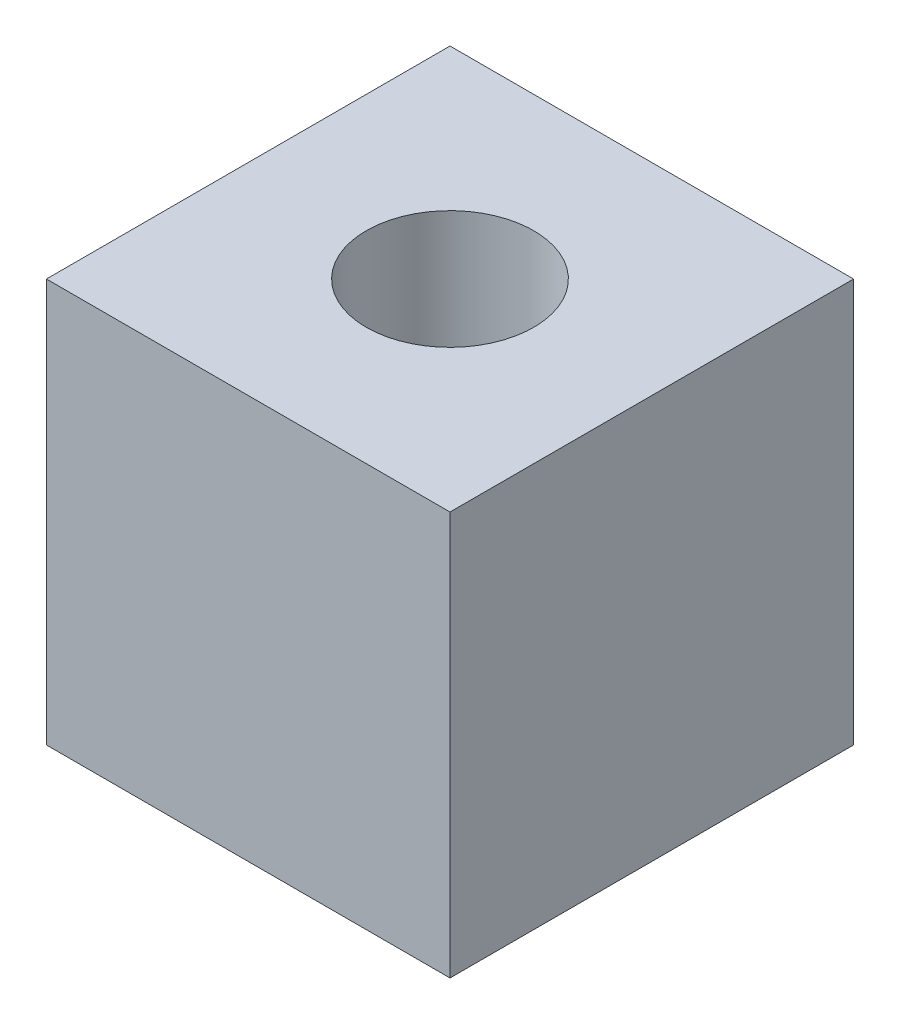
ISO-10303-21;
HEADER;
FILE_DESCRIPTION(('STEP AP214'),'2;1');
FILE_NAME('part.step','',(''),(''),'','','');
FILE_SCHEMA(('AUTOMOTIVE_DESIGN { 1 0 10303 214 1 1 1 1 }'));
ENDSEC;
DATA;
#1=APPLICATION_CONTEXT('core data for automotive mechanical design processes');
#2=APPLICATION_PROTOCOL_DEFINITION('international standard','automotive_design',2000,#1);
#3=PRODUCT_CONTEXT('',#1,'mechanical');
#4=PRODUCT('Part','Part','',(#3));
#5=PRODUCT_RELATED_PRODUCT_CATEGORY('part','',(#4));
#6=PRODUCT_DEFINITION_FORMATION('','',#4);
#7=PRODUCT_DEFINITION_CONTEXT('part definition',#1,'design');
#8=PRODUCT_DEFINITION('design','',#6,#7);
#9=PRODUCT_DEFINITION_SHAPE('','',#8);
#10=(LENGTH_UNIT() NAMED_UNIT(*) SI_UNIT(.MILLI.,.METRE.));
#11=(NAMED_UNIT(*) PLANE_ANGLE_UNIT() SI_UNIT($,.RADIAN.));
#12=(NAMED_UNIT(*) SI_UNIT($,.STERADIAN.) SOLID_ANGLE_UNIT());
#13=UNCERTAINTY_MEASURE_WITH_UNIT(LENGTH_MEASURE(1.E-05),#10,'distance_accuracy_value','');
#14=(GEOMETRIC_REPRESENTATION_CONTEXT(3) GLOBAL_UNCERTAINTY_ASSIGNED_CONTEXT((#13)) GLOBAL_UNIT_ASSIGNED_CONTEXT((#10,
#11,#12)) REPRESENTATION_CONTEXT('',''));
#15=CARTESIAN_POINT('',(0.,0.,0.));
#16=DIRECTION('',(0.,0.,1.));
#17=DIRECTION('',(1.,0.,0.));
#18=AXIS2_PLACEMENT_3D('',#15,#16,#17);
#19=CARTESIAN_POINT('',(0.,20.,0.));
#20=DIRECTION('',(-1.,0.,0.));
#21=DIRECTION('',(0.,0.,1.));
#22=AXIS2_PLACEMENT_3D('',#19,#20,#21);
#23=PLANE('',#22);
#24=DIRECTION('',(0.,0.,-1.));
#25=VECTOR('',#24,1.);
#26=CARTESIAN_POINT('',(0.,0.,0.));
#27=LINE('',#26,#25);
#28=CARTESIAN_POINT('',(0.,0.,0.));
#29=VERTEX_POINT('',#28);
#30=CARTESIAN_POINT('',(0.,0.,-20.));
#31=VERTEX_POINT('',#30);
#32=EDGE_CURVE('E111',#29,#31,#27,.T.);
#33=ORIENTED_EDGE('',*,*,#32,.T.);
#34=DIRECTION('',(0.,-1.,0.));
#35=VECTOR('',#34,1.);
#36=CARTESIAN_POINT('',(0.,20.,-20.));
#37=LINE('',#36,#35);
#38=CARTESIAN_POINT('',(0.,20.,-20.));
#39=VERTEX_POINT('',#38);
#40=EDGE_CURVE('E11',#39,#31,#37,.T.);
#41=ORIENTED_EDGE('',*,*,#40,.F.);
#42=DIRECTION('',(0.,0.,-1.));
#43=VECTOR('',#42,1.);
#44=CARTESIAN_POINT('',(0.,20.,0.));
#45=LINE('',#44,#43);
#46=CARTESIAN_POINT('',(0.,20.,0.));
#47=VERTEX_POINT('',#46);
#48=EDGE_CURVE('E95',#47,#39,#45,.T.);
#49=ORIENTED_EDGE('',*,*,#48,.F.);
#50=DIRECTION('',(0.,-1.,0.));
#51=VECTOR('',#50,1.);
#52=CARTESIAN_POINT('',(0.,20.,0.));
#53=LINE('',#52,#51);
#54=EDGE_CURVE('E107',#47,#29,#53,.T.);
#55=ORIENTED_EDGE('',*,*,#54,.T.);
#56=EDGE_LOOP('',(#33,#41,#49,#55));
#57=FACE_BOUND('',#56,.T.);
#58=ADVANCED_FACE('F43',(#57),#23,.F.);
#59=CARTESIAN_POINT('',(0.,20.,-20.));
#60=DIRECTION('',(0.,0.,1.));
#61=DIRECTION('',(1.,0.,0.));
#62=AXIS2_PLACEMENT_3D('',#59,#60,#61);
#63=PLANE('',#62);
#64=DIRECTION('',(-1.,0.,0.));
#65=VECTOR('',#64,1.);
#66=CARTESIAN_POINT('',(0.,0.,-20.));
#67=LINE('',#66,#65);
#68=CARTESIAN_POINT('',(-20.,0.,-20.));
#69=VERTEX_POINT('',#68);
#70=EDGE_CURVE('E100',#31,#69,#67,.T.);
#71=ORIENTED_EDGE('',*,*,#70,.T.);
#72=DIRECTION('',(0.,-1.,0.));
#73=VECTOR('',#72,1.);
#74=CARTESIAN_POINT('',(-20.,20.,-20.));
#75=LINE('',#74,#73);
#76=CARTESIAN_POINT('',(-20.,20.,-20.));
#77=VERTEX_POINT('',#76);
#78=EDGE_CURVE('E52',#77,#69,#75,.T.);
#79=ORIENTED_EDGE('',*,*,#78,.F.);
#80=DIRECTION('',(-1.,0.,0.));
#81=VECTOR('',#80,1.);
#82=CARTESIAN_POINT('',(0.,20.,-20.));
#83=LINE('',#82,#81);
#84=EDGE_CURVE('E90',#39,#77,#83,.T.);
#85=ORIENTED_EDGE('',*,*,#84,.F.);
#86=ORIENTED_EDGE('',*,*,#40,.T.);
#87=EDGE_LOOP('',(#71,#79,#85,#86));
#88=FACE_BOUND('',#87,.T.);
#89=ADVANCED_FACE('F99',(#88),#63,.F.);
#90=CARTESIAN_POINT('',(-20.,20.,0.));
#91=DIRECTION('',(1.,0.,0.));
#92=DIRECTION('',(0.,0.,-1.));
#93=AXIS2_PLACEMENT_3D('',#90,#91,#92);
#94=PLANE('',#93);
#95=DIRECTION('',(0.,0.,1.));
#96=VECTOR('',#95,1.);
#97=CARTESIAN_POINT('',(-20.,0.,0.));
#98=LINE('',#97,#96);
#99=CARTESIAN_POINT('',(-20.,0.,0.));
#100=VERTEX_POINT('',#99);
#101=EDGE_CURVE('E77',#69,#100,#98,.T.);
#102=ORIENTED_EDGE('',*,*,#101,.T.);
#103=DIRECTION('',(0.,-1.,0.));
#104=VECTOR('',#103,1.);
#105=CARTESIAN_POINT('',(-20.,20.,0.));
#106=LINE('',#105,#104);
#107=CARTESIAN_POINT('',(-20.,20.,0.));
#108=VERTEX_POINT('',#107);
#109=EDGE_CURVE('E102',#108,#100,#106,.T.);
#110=ORIENTED_EDGE('',*,*,#109,.F.);
#111=DIRECTION('',(0.,0.,1.));
#112=VECTOR('',#111,1.);
#113=CARTESIAN_POINT('',(-20.,20.,0.));
#114=LINE('',#113,#112);
#115=EDGE_CURVE('E93',#77,#108,#114,.T.);
#116=ORIENTED_EDGE('',*,*,#115,.F.);
#117=ORIENTED_EDGE('',*,*,#78,.T.);
#118=EDGE_LOOP('',(#102,#110,#116,#117));
#119=FACE_BOUND('',#118,.T.);
#120=ADVANCED_FACE('F103',(#119),#94,.F.);
#121=CARTESIAN_POINT('',(0.,20.,0.));
#122=DIRECTION('',(0.,0.,-1.));
#123=DIRECTION('',(-1.,0.,0.));
#124=AXIS2_PLACEMENT_3D('',#121,#122,#123);
#125=PLANE('',#124);
#126=DIRECTION('',(1.,0.,0.));
#127=VECTOR('',#126,1.);
#128=CARTESIAN_POINT('',(0.,0.,0.));
#129=LINE('',#128,#127);
#130=EDGE_CURVE('E83',#100,#29,#129,.T.);
#131=ORIENTED_EDGE('',*,*,#130,.T.);
#132=ORIENTED_EDGE('',*,*,#54,.F.);
#133=DIRECTION('',(1.,0.,0.));
#134=VECTOR('',#133,1.);
#135=CARTESIAN_POINT('',(0.,20.,0.));
#136=LINE('',#135,#134);
#137=EDGE_CURVE('E60',#108,#47,#136,.T.);
#138=ORIENTED_EDGE('',*,*,#137,.F.);
#139=ORIENTED_EDGE('',*,*,#109,.T.);
#140=EDGE_LOOP('',(#131,#132,#138,#139));
#141=FACE_BOUND('',#140,.T.);
#142=ADVANCED_FACE('F125',(#141),#125,.F.);
#143=CARTESIAN_POINT('',(0.,20.,0.));
#144=DIRECTION('',(0.,1.,0.));
#145=DIRECTION('',(0.,0.,1.));
#146=AXIS2_PLACEMENT_3D('',#143,#144,#145);
#147=PLANE('',#146);
#148=CARTESIAN_POINT('',(-10.,20.,-10.));
#149=DIRECTION('',(0.,1.,0.));
#150=DIRECTION('',(0.,0.,1.));
#151=AXIS2_PLACEMENT_3D('',#148,#149,#150);
#152=CIRCLE('',#151,4.15);
#153=CARTESIAN_POINT('',(-10.,20.,-5.85));
#154=VERTEX_POINT('',#153);
#155=EDGE_CURVE('E132',#154,#154,#152,.T.);
#156=ORIENTED_EDGE('',*,*,#155,.F.);
#157=EDGE_LOOP('',(#156));
#158=FACE_BOUND('',#157,.T.);
#159=ORIENTED_EDGE('',*,*,#48,.T.);
#160=ORIENTED_EDGE('',*,*,#84,.T.);
#161=ORIENTED_EDGE('',*,*,#115,.T.);
#162=ORIENTED_EDGE('',*,*,#137,.T.);
#163=EDGE_LOOP('',(#159,#160,#161,#162));
#164=FACE_BOUND('',#163,.T.);
#165=ADVANCED_FACE('F91',(#158,#164),#147,.T.);
#166=CARTESIAN_POINT('',(0.,0.,0.));
#167=DIRECTION('',(0.,1.,0.));
#168=DIRECTION('',(0.,0.,1.));
#169=AXIS2_PLACEMENT_3D('',#166,#167,#168);
#170=PLANE('',#169);
#171=CARTESIAN_POINT('',(-10.,0.,-10.));
#172=DIRECTION('',(0.,1.,0.));
#173=DIRECTION('',(0.,0.,1.));
#174=AXIS2_PLACEMENT_3D('',#171,#172,#173);
#175=CIRCLE('',#174,4.15);
#176=CARTESIAN_POINT('',(-10.,0.,-5.85));
#177=VERTEX_POINT('',#176);
#178=EDGE_CURVE('E115',#177,#177,#175,.T.);
#179=ORIENTED_EDGE('',*,*,#178,.T.);
#180=EDGE_LOOP('',(#179));
#181=FACE_BOUND('',#180,.T.);
#182=ORIENTED_EDGE('',*,*,#32,.F.);
#183=ORIENTED_EDGE('',*,*,#130,.F.);
#184=ORIENTED_EDGE('',*,*,#101,.F.);
#185=ORIENTED_EDGE('',*,*,#70,.F.);
#186=EDGE_LOOP('',(#182,#183,#184,#185));
#187=FACE_BOUND('',#186,.T.);
#188=ADVANCED_FACE('F128',(#181,#187),#170,.F.);
#189=CARTESIAN_POINT('',(-10.,0.,-10.));
#190=DIRECTION('',(0.,1.,0.));
#191=DIRECTION('',(0.,0.,1.));
#192=AXIS2_PLACEMENT_3D('',#189,#190,#191);
#193=CYLINDRICAL_SURFACE('',#192,4.15);
#194=ORIENTED_EDGE('',*,*,#178,.F.);
#195=EDGE_LOOP('',(#194));
#196=FACE_BOUND('',#195,.T.);
#197=ORIENTED_EDGE('',*,*,#155,.T.);
#198=EDGE_LOOP('',(#197));
#199=FACE_BOUND('',#198,.T.);
#200=ADVANCED_FACE('F141',(#196,#199),#193,.F.);
#201=CLOSED_SHELL('',(#58,#89,#120,#142,#165,#188,#200));
#202=MANIFOLD_SOLID_BREP('B2',#201);
#203=ADVANCED_BREP_SHAPE_REPRESENTATION('',(#18,#202),#14);
#204=SHAPE_DEFINITION_REPRESENTATION(#9,#203);
ENDSEC;
END-ISO-10303-21;
